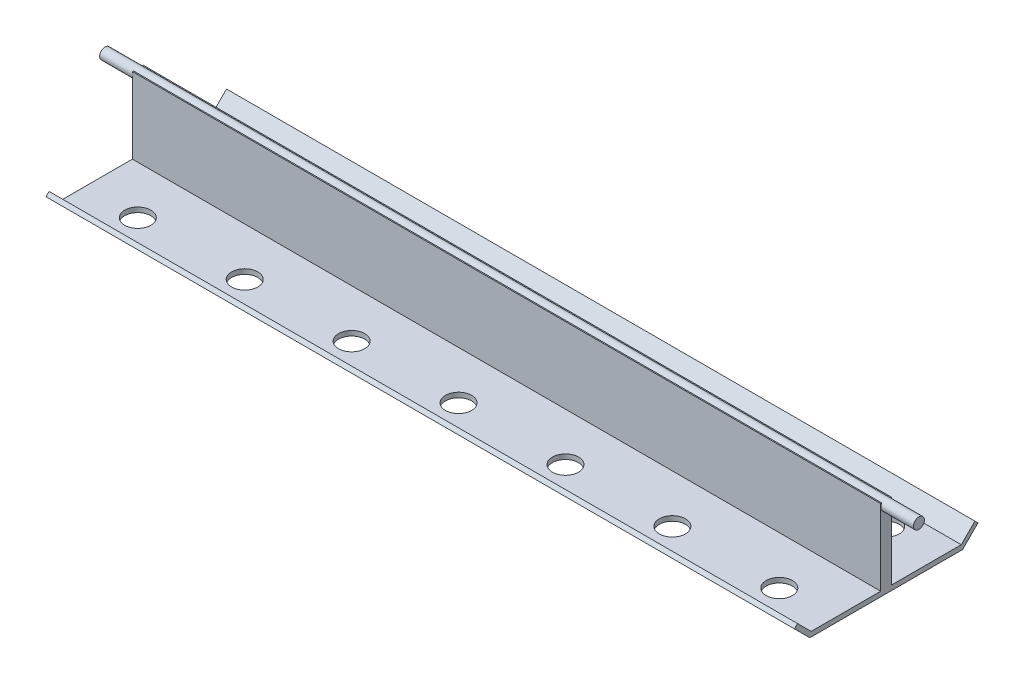
ISO-10303-21;
HEADER;
FILE_DESCRIPTION(('STEP AP214'),'2;1');
FILE_NAME('part.step','',(''),(''),'','','');
FILE_SCHEMA(('AUTOMOTIVE_DESIGN { 1 0 10303 214 1 1 1 1 }'));
ENDSEC;
DATA;
#1=APPLICATION_CONTEXT('core data for automotive mechanical design processes');
#2=APPLICATION_PROTOCOL_DEFINITION('international standard','automotive_design',2000,#1);
#3=PRODUCT_CONTEXT('',#1,'mechanical');
#4=PRODUCT('Part','Part','',(#3));
#5=PRODUCT_RELATED_PRODUCT_CATEGORY('part','',(#4));
#6=PRODUCT_DEFINITION_FORMATION('','',#4);
#7=PRODUCT_DEFINITION_CONTEXT('part definition',#1,'design');
#8=PRODUCT_DEFINITION('design','',#6,#7);
#9=PRODUCT_DEFINITION_SHAPE('','',#8);
#10=(LENGTH_UNIT() NAMED_UNIT(*) SI_UNIT(.MILLI.,.METRE.));
#11=(NAMED_UNIT(*) PLANE_ANGLE_UNIT() SI_UNIT($,.RADIAN.));
#12=(NAMED_UNIT(*) SI_UNIT($,.STERADIAN.) SOLID_ANGLE_UNIT());
#13=UNCERTAINTY_MEASURE_WITH_UNIT(LENGTH_MEASURE(1.E-05),#10,'distance_accuracy_value','');
#14=(GEOMETRIC_REPRESENTATION_CONTEXT(3) GLOBAL_UNCERTAINTY_ASSIGNED_CONTEXT((#13)) GLOBAL_UNIT_ASSIGNED_CONTEXT((#10,
#11,#12)) REPRESENTATION_CONTEXT('',''));
#15=CARTESIAN_POINT('',(0.,0.,0.));
#16=DIRECTION('',(0.,0.,1.));
#17=DIRECTION('',(1.,0.,0.));
#18=AXIS2_PLACEMENT_3D('',#15,#16,#17);
#19=CARTESIAN_POINT('',(171.5,35.,2.5));
#20=DIRECTION('',(-1.,0.,0.));
#21=DIRECTION('',(0.,0.,1.));
#22=AXIS2_PLACEMENT_3D('',#19,#20,#21);
#23=PLANE('',#22);
#24=DIRECTION('',(0.,-1.,0.));
#25=VECTOR('',#24,1.);
#26=CARTESIAN_POINT('',(171.5,35.,2.5));
#27=LINE('',#26,#25);
#28=CARTESIAN_POINT('',(171.5,35.,2.5));
#29=VERTEX_POINT('',#28);
#30=CARTESIAN_POINT('',(171.5,33.5,2.5));
#31=VERTEX_POINT('',#30);
#32=EDGE_CURVE('E240',#29,#31,#27,.T.);
#33=ORIENTED_EDGE('',*,*,#32,.T.);
#34=CARTESIAN_POINT('',(171.5,33.5,0.));
#35=DIRECTION('',(-1.,0.,0.));
#36=DIRECTION('',(0.,0.,1.));
#37=AXIS2_PLACEMENT_3D('',#34,#35,#36);
#38=CIRCLE('',#37,2.5);
#39=CARTESIAN_POINT('',(171.5,35.,2.));
#40=VERTEX_POINT('',#39);
#41=EDGE_CURVE('E228',#31,#40,#38,.T.);
#42=ORIENTED_EDGE('',*,*,#41,.T.);
#43=DIRECTION('',(0.,0.,-1.));
#44=VECTOR('',#43,1.);
#45=CARTESIAN_POINT('',(171.5,35.,2.5));
#46=LINE('',#45,#44);
#47=EDGE_CURVE('E229',#29,#40,#46,.T.);
#48=ORIENTED_EDGE('',*,*,#47,.F.);
#49=EDGE_LOOP('',(#33,#42,#48));
#50=FACE_BOUND('',#49,.T.);
#51=ADVANCED_FACE('F32',(#50),#23,.F.);
#52=CARTESIAN_POINT('',(171.5,35.,-2.));
#53=VERTEX_POINT('',#52);
#54=CARTESIAN_POINT('',(171.5,35.,-2.5));
#55=VERTEX_POINT('',#54);
#56=EDGE_CURVE('E232',#53,#55,#46,.T.);
#57=ORIENTED_EDGE('',*,*,#56,.F.);
#58=CARTESIAN_POINT('',(171.5,33.5,-2.5));
#59=VERTEX_POINT('',#58);
#60=EDGE_CURVE('E47',#53,#59,#38,.T.);
#61=ORIENTED_EDGE('',*,*,#60,.T.);
#62=DIRECTION('',(0.,-1.,0.));
#63=VECTOR('',#62,1.);
#64=CARTESIAN_POINT('',(171.5,35.,-2.5));
#65=LINE('',#64,#63);
#66=EDGE_CURVE('E252',#55,#59,#65,.T.);
#67=ORIENTED_EDGE('',*,*,#66,.F.);
#68=EDGE_LOOP('',(#57,#61,#67));
#69=FACE_BOUND('',#68,.T.);
#70=ADVANCED_FACE('F275',(#69),#23,.F.);
#71=CARTESIAN_POINT('',(-171.5,35.,2.5));
#72=DIRECTION('',(1.,0.,0.));
#73=DIRECTION('',(0.,0.,-1.));
#74=AXIS2_PLACEMENT_3D('',#71,#72,#73);
#75=PLANE('',#74);
#76=DIRECTION('',(0.,-1.,0.));
#77=VECTOR('',#76,1.);
#78=CARTESIAN_POINT('',(-171.5,35.,-2.5));
#79=LINE('',#78,#77);
#80=CARTESIAN_POINT('',(-171.5,35.,-2.5));
#81=VERTEX_POINT('',#80);
#82=CARTESIAN_POINT('',(-171.5,33.5,-2.5));
#83=VERTEX_POINT('',#82);
#84=EDGE_CURVE('E248',#81,#83,#79,.T.);
#85=ORIENTED_EDGE('',*,*,#84,.T.);
#86=CARTESIAN_POINT('',(-171.5,33.5,0.));
#87=DIRECTION('',(1.,0.,0.));
#88=DIRECTION('',(0.,0.,-1.));
#89=AXIS2_PLACEMENT_3D('',#86,#87,#88);
#90=CIRCLE('',#89,2.5);
#91=CARTESIAN_POINT('',(-171.5,35.,-2.));
#92=VERTEX_POINT('',#91);
#93=EDGE_CURVE('E220',#83,#92,#90,.T.);
#94=ORIENTED_EDGE('',*,*,#93,.T.);
#95=DIRECTION('',(0.,0.,1.));
#96=VECTOR('',#95,1.);
#97=CARTESIAN_POINT('',(-171.5,35.,2.5));
#98=LINE('',#97,#96);
#99=EDGE_CURVE('E235',#81,#92,#98,.T.);
#100=ORIENTED_EDGE('',*,*,#99,.F.);
#101=EDGE_LOOP('',(#85,#94,#100));
#102=FACE_BOUND('',#101,.T.);
#103=ADVANCED_FACE('F292',(#102),#75,.F.);
#104=CARTESIAN_POINT('',(-171.5,35.,2.));
#105=VERTEX_POINT('',#104);
#106=CARTESIAN_POINT('',(-171.5,35.,2.5));
#107=VERTEX_POINT('',#106);
#108=EDGE_CURVE('E234',#105,#107,#98,.T.);
#109=ORIENTED_EDGE('',*,*,#108,.F.);
#110=CARTESIAN_POINT('',(-171.5,33.5,2.5));
#111=VERTEX_POINT('',#110);
#112=EDGE_CURVE('E225',#105,#111,#90,.T.);
#113=ORIENTED_EDGE('',*,*,#112,.T.);
#114=DIRECTION('',(0.,-1.,0.));
#115=VECTOR('',#114,1.);
#116=CARTESIAN_POINT('',(-171.5,35.,2.5));
#117=LINE('',#116,#115);
#118=EDGE_CURVE('E244',#107,#111,#117,.T.);
#119=ORIENTED_EDGE('',*,*,#118,.F.);
#120=EDGE_LOOP('',(#109,#113,#119));
#121=FACE_BOUND('',#120,.T.);
#122=ADVANCED_FACE('F264',(#121),#75,.F.);
#123=CARTESIAN_POINT('',(0.,35.,0.));
#124=DIRECTION('',(0.,-1.,0.));
#125=DIRECTION('',(0.,0.,-1.));
#126=AXIS2_PLACEMENT_3D('',#123,#124,#125);
#127=PLANE('',#126);
#128=ORIENTED_EDGE('',*,*,#47,.T.);
#129=DIRECTION('',(-1.,0.,0.));
#130=VECTOR('',#129,1.);
#131=CARTESIAN_POINT('',(186.5,35.,2.));
#132=LINE('',#131,#130);
#133=EDGE_CURVE('E40',#40,#105,#132,.T.);
#134=ORIENTED_EDGE('',*,*,#133,.T.);
#135=ORIENTED_EDGE('',*,*,#108,.T.);
#136=DIRECTION('',(1.,0.,0.));
#137=VECTOR('',#136,1.);
#138=CARTESIAN_POINT('',(-171.5,35.,2.5));
#139=LINE('',#138,#137);
#140=EDGE_CURVE('E55',#107,#29,#139,.T.);
#141=ORIENTED_EDGE('',*,*,#140,.T.);
#142=EDGE_LOOP('',(#128,#134,#135,#141));
#143=FACE_BOUND('',#142,.T.);
#144=ADVANCED_FACE('F258',(#143),#127,.F.);
#145=CARTESIAN_POINT('',(171.5,0.230710143300813,2.5));
#146=VERTEX_POINT('',#145);
#147=EDGE_CURVE('E239',#31,#146,#27,.T.);
#148=ORIENTED_EDGE('',*,*,#147,.T.);
#149=DIRECTION('',(0.,0.,1.));
#150=VECTOR('',#149,1.);
#151=CARTESIAN_POINT('',(171.5,0.230710143300809,34.4022830185546));
#152=LINE('',#151,#150);
#153=CARTESIAN_POINT('',(171.5,0.230710143300809,34.4022830185546));
#154=VERTEX_POINT('',#153);
#155=EDGE_CURVE('E187',#146,#154,#152,.T.);
#156=ORIENTED_EDGE('',*,*,#155,.T.);
#157=DIRECTION('',(0.,0.707106781186549,0.707106781186546));
#158=VECTOR('',#157,1.);
#159=CARTESIAN_POINT('',(171.5,6.48528137423857,40.6568542494924));
#160=LINE('',#159,#158);
#161=CARTESIAN_POINT('',(171.5,6.48528137423857,40.6568542494924));
#162=VERTEX_POINT('',#161);
#163=EDGE_CURVE('E191',#154,#162,#160,.T.);
#164=ORIENTED_EDGE('',*,*,#163,.T.);
#165=DIRECTION('',(0.,-0.707106781186547,0.707106781186548));
#166=VECTOR('',#165,1.);
#167=CARTESIAN_POINT('',(171.5,5.07106781186548,42.0710678118655));
#168=LINE('',#167,#166);
#169=CARTESIAN_POINT('',(171.5,5.07106781186548,42.0710678118655));
#170=VERTEX_POINT('',#169);
#171=EDGE_CURVE('E158',#162,#170,#168,.T.);
#172=ORIENTED_EDGE('',*,*,#171,.T.);
#173=DIRECTION('',(0.,-0.707106781186549,-0.707106781186546));
#174=VECTOR('',#173,1.);
#175=CARTESIAN_POINT('',(171.5,-2.,35.));
#176=LINE('',#175,#174);
#177=CARTESIAN_POINT('',(171.5,-2.,35.));
#178=VERTEX_POINT('',#177);
#179=EDGE_CURVE('E152',#170,#178,#176,.T.);
#180=ORIENTED_EDGE('',*,*,#179,.T.);
#181=DIRECTION('',(0.,0.,-1.));
#182=VECTOR('',#181,1.);
#183=CARTESIAN_POINT('',(171.5,-2.,35.));
#184=LINE('',#183,#182);
#185=CARTESIAN_POINT('',(171.5,-2.,-35.));
#186=VERTEX_POINT('',#185);
#187=EDGE_CURVE('E161',#178,#186,#184,.T.);
#188=ORIENTED_EDGE('',*,*,#187,.T.);
#189=DIRECTION('',(0.,0.707106781186549,-0.707106781186546));
#190=VECTOR('',#189,1.);
#191=CARTESIAN_POINT('',(171.5,-2.,-35.));
#192=LINE('',#191,#190);
#193=CARTESIAN_POINT('',(171.5,5.07106781186549,-42.0710678118655));
#194=VERTEX_POINT('',#193);
#195=EDGE_CURVE('E167',#186,#194,#192,.T.);
#196=ORIENTED_EDGE('',*,*,#195,.T.);
#197=DIRECTION('',(0.,0.707106781186547,0.707106781186548));
#198=VECTOR('',#197,1.);
#199=CARTESIAN_POINT('',(171.5,5.07106781186549,-42.0710678118655));
#200=LINE('',#199,#198);
#201=CARTESIAN_POINT('',(171.5,6.48528137423858,-40.6568542494924));
#202=VERTEX_POINT('',#201);
#203=EDGE_CURVE('E181',#194,#202,#200,.T.);
#204=ORIENTED_EDGE('',*,*,#203,.T.);
#205=DIRECTION('',(0.,-0.707106781186549,0.707106781186546));
#206=VECTOR('',#205,1.);
#207=CARTESIAN_POINT('',(171.5,6.48528137423858,-40.6568542494924));
#208=LINE('',#207,#206);
#209=CARTESIAN_POINT('',(171.5,0.230710143300818,-34.4022830185546));
#210=VERTEX_POINT('',#209);
#211=EDGE_CURVE('E184',#202,#210,#208,.T.);
#212=ORIENTED_EDGE('',*,*,#211,.T.);
#213=CARTESIAN_POINT('',(171.5,0.230710143300814,-2.5));
#214=VERTEX_POINT('',#213);
#215=EDGE_CURVE('E188',#210,#214,#152,.T.);
#216=ORIENTED_EDGE('',*,*,#215,.T.);
#217=EDGE_CURVE('E251',#59,#214,#65,.T.);
#218=ORIENTED_EDGE('',*,*,#217,.F.);
#219=EDGE_CURVE('E223',#59,#31,#38,.T.);
#220=ORIENTED_EDGE('',*,*,#219,.T.);
#221=EDGE_LOOP('',(#148,#156,#164,#172,#180,#188,#196,#204,#212,#216,#218,#220));
#222=FACE_BOUND('',#221,.T.);
#223=ADVANCED_FACE('F34',(#222),#23,.F.);
#224=CARTESIAN_POINT('',(-171.5,35.,-2.5));
#225=DIRECTION('',(0.,0.,1.));
#226=DIRECTION('',(1.,0.,0.));
#227=AXIS2_PLACEMENT_3D('',#224,#225,#226);
#228=PLANE('',#227);
#229=ORIENTED_EDGE('',*,*,#217,.T.);
#230=DIRECTION('',(-1.,0.,0.));
#231=VECTOR('',#230,1.);
#232=CARTESIAN_POINT('',(-171.5,0.230710143300818,-2.5));
#233=LINE('',#232,#231);
#234=CARTESIAN_POINT('',(-171.5,0.230710143300814,-2.5));
#235=VERTEX_POINT('',#234);
#236=EDGE_CURVE('E211',#214,#235,#233,.T.);
#237=ORIENTED_EDGE('',*,*,#236,.T.);
#238=EDGE_CURVE('E247',#83,#235,#79,.T.);
#239=ORIENTED_EDGE('',*,*,#238,.F.);
#240=ORIENTED_EDGE('',*,*,#84,.F.);
#241=DIRECTION('',(-1.,0.,0.));
#242=VECTOR('',#241,1.);
#243=CARTESIAN_POINT('',(-171.5,35.,-2.5));
#244=LINE('',#243,#242);
#245=EDGE_CURVE('E231',#55,#81,#244,.T.);
#246=ORIENTED_EDGE('',*,*,#245,.F.);
#247=ORIENTED_EDGE('',*,*,#66,.T.);
#248=EDGE_LOOP('',(#229,#237,#239,#240,#246,#247));
#249=FACE_BOUND('',#248,.T.);
#250=ADVANCED_FACE('F280',(#249),#228,.F.);
#251=ORIENTED_EDGE('',*,*,#238,.T.);
#252=DIRECTION('',(0.,0.,-1.));
#253=VECTOR('',#252,1.);
#254=CARTESIAN_POINT('',(-171.5,0.230710143300809,34.4022830185546));
#255=LINE('',#254,#253);
#256=CARTESIAN_POINT('',(-171.5,0.230710143300818,-34.4022830185546));
#257=VERTEX_POINT('',#256);
#258=EDGE_CURVE('E705',#235,#257,#255,.T.);
#259=ORIENTED_EDGE('',*,*,#258,.T.);
#260=DIRECTION('',(0.,0.707106781186549,-0.707106781186546));
#261=VECTOR('',#260,1.);
#262=CARTESIAN_POINT('',(-171.5,6.48528137423858,-40.6568542494924));
#263=LINE('',#262,#261);
#264=CARTESIAN_POINT('',(-171.5,6.48528137423858,-40.6568542494924));
#265=VERTEX_POINT('',#264);
#266=EDGE_CURVE('E703',#257,#265,#263,.T.);
#267=ORIENTED_EDGE('',*,*,#266,.T.);
#268=DIRECTION('',(0.,-0.707106781186547,-0.707106781186548));
#269=VECTOR('',#268,1.);
#270=CARTESIAN_POINT('',(-171.5,5.07106781186549,-42.0710678118655));
#271=LINE('',#270,#269);
#272=CARTESIAN_POINT('',(-171.5,5.07106781186549,-42.0710678118655));
#273=VERTEX_POINT('',#272);
#274=EDGE_CURVE('E701',#265,#273,#271,.T.);
#275=ORIENTED_EDGE('',*,*,#274,.T.);
#276=DIRECTION('',(0.,-0.707106781186549,0.707106781186546));
#277=VECTOR('',#276,1.);
#278=CARTESIAN_POINT('',(-171.5,-2.,-35.));
#279=LINE('',#278,#277);
#280=CARTESIAN_POINT('',(-171.5,-2.,-35.));
#281=VERTEX_POINT('',#280);
#282=EDGE_CURVE('E196',#273,#281,#279,.T.);
#283=ORIENTED_EDGE('',*,*,#282,.T.);
#284=DIRECTION('',(0.,0.,1.));
#285=VECTOR('',#284,1.);
#286=CARTESIAN_POINT('',(-171.5,-2.,35.));
#287=LINE('',#286,#285);
#288=CARTESIAN_POINT('',(-171.5,-2.,35.));
#289=VERTEX_POINT('',#288);
#290=EDGE_CURVE('E209',#281,#289,#287,.T.);
#291=ORIENTED_EDGE('',*,*,#290,.T.);
#292=DIRECTION('',(0.,0.707106781186549,0.707106781186546));
#293=VECTOR('',#292,1.);
#294=CARTESIAN_POINT('',(-171.5,-2.,35.));
#295=LINE('',#294,#293);
#296=CARTESIAN_POINT('',(-171.5,5.07106781186548,42.0710678118655));
#297=VERTEX_POINT('',#296);
#298=EDGE_CURVE('E154',#289,#297,#295,.T.);
#299=ORIENTED_EDGE('',*,*,#298,.T.);
#300=DIRECTION('',(0.,0.707106781186547,-0.707106781186548));
#301=VECTOR('',#300,1.);
#302=CARTESIAN_POINT('',(-171.5,5.07106781186548,42.0710678118655));
#303=LINE('',#302,#301);
#304=CARTESIAN_POINT('',(-171.5,6.48528137423857,40.6568542494924));
#305=VERTEX_POINT('',#304);
#306=EDGE_CURVE('E709',#297,#305,#303,.T.);
#307=ORIENTED_EDGE('',*,*,#306,.T.);
#308=DIRECTION('',(0.,-0.707106781186549,-0.707106781186546));
#309=VECTOR('',#308,1.);
#310=CARTESIAN_POINT('',(-171.5,6.48528137423857,40.6568542494924));
#311=LINE('',#310,#309);
#312=CARTESIAN_POINT('',(-171.5,0.230710143300809,34.4022830185546));
#313=VERTEX_POINT('',#312);
#314=EDGE_CURVE('E708',#305,#313,#311,.T.);
#315=ORIENTED_EDGE('',*,*,#314,.T.);
#316=CARTESIAN_POINT('',(-171.5,0.230710143300813,2.5));
#317=VERTEX_POINT('',#316);
#318=EDGE_CURVE('E706',#313,#317,#255,.T.);
#319=ORIENTED_EDGE('',*,*,#318,.T.);
#320=EDGE_CURVE('E243',#111,#317,#117,.T.);
#321=ORIENTED_EDGE('',*,*,#320,.F.);
#322=EDGE_CURVE('E224',#111,#83,#90,.T.);
#323=ORIENTED_EDGE('',*,*,#322,.T.);
#324=EDGE_LOOP('',(#251,#259,#267,#275,#283,#291,#299,#307,#315,#319,#321,#323));
#325=FACE_BOUND('',#324,.T.);
#326=ADVANCED_FACE('F289',(#325),#75,.F.);
#327=CARTESIAN_POINT('',(-171.5,35.,2.5));
#328=DIRECTION('',(0.,0.,-1.));
#329=DIRECTION('',(-1.,0.,0.));
#330=AXIS2_PLACEMENT_3D('',#327,#328,#329);
#331=PLANE('',#330);
#332=ORIENTED_EDGE('',*,*,#320,.T.);
#333=DIRECTION('',(1.,0.,0.));
#334=VECTOR('',#333,1.);
#335=CARTESIAN_POINT('',(-171.5,0.230710143300818,2.5));
#336=LINE('',#335,#334);
#337=EDGE_CURVE('E11',#317,#146,#336,.T.);
#338=ORIENTED_EDGE('',*,*,#337,.T.);
#339=ORIENTED_EDGE('',*,*,#147,.F.);
#340=ORIENTED_EDGE('',*,*,#32,.F.);
#341=ORIENTED_EDGE('',*,*,#140,.F.);
#342=ORIENTED_EDGE('',*,*,#118,.T.);
#343=EDGE_LOOP('',(#332,#338,#339,#340,#341,#342));
#344=FACE_BOUND('',#343,.T.);
#345=ADVANCED_FACE('F268',(#344),#331,.F.);
#346=ORIENTED_EDGE('',*,*,#99,.T.);
#347=DIRECTION('',(-1.,0.,0.));
#348=VECTOR('',#347,1.);
#349=CARTESIAN_POINT('',(186.5,35.,-2.));
#350=LINE('',#349,#348);
#351=EDGE_CURVE('E255',#92,#53,#350,.F.);
#352=ORIENTED_EDGE('',*,*,#351,.T.);
#353=ORIENTED_EDGE('',*,*,#56,.T.);
#354=ORIENTED_EDGE('',*,*,#245,.T.);
#355=EDGE_LOOP('',(#346,#352,#353,#354));
#356=FACE_BOUND('',#355,.T.);
#357=ADVANCED_FACE('F285',(#356),#127,.F.);
#358=CARTESIAN_POINT('',(186.5,33.5,0.));
#359=DIRECTION('',(-1.,0.,0.));
#360=DIRECTION('',(0.,0.,1.));
#361=AXIS2_PLACEMENT_3D('',#358,#359,#360);
#362=CYLINDRICAL_SURFACE('',#361,2.5);
#363=CARTESIAN_POINT('',(186.5,33.5,0.));
#364=DIRECTION('',(-1.,0.,0.));
#365=DIRECTION('',(0.,0.,1.));
#366=AXIS2_PLACEMENT_3D('',#363,#364,#365);
#367=CIRCLE('',#366,2.5);
#368=CARTESIAN_POINT('',(186.5,33.5,2.5));
#369=VERTEX_POINT('',#368);
#370=EDGE_CURVE('E217',#369,#369,#367,.T.);
#371=ORIENTED_EDGE('',*,*,#370,.T.);
#372=EDGE_LOOP('',(#371));
#373=FACE_BOUND('',#372,.T.);
#374=CARTESIAN_POINT('',(-186.5,33.5,0.));
#375=DIRECTION('',(-1.,0.,0.));
#376=DIRECTION('',(0.,0.,1.));
#377=AXIS2_PLACEMENT_3D('',#374,#375,#376);
#378=CIRCLE('',#377,2.5);
#379=CARTESIAN_POINT('',(-186.5,33.5,2.5));
#380=VERTEX_POINT('',#379);
#381=EDGE_CURVE('E214',#380,#380,#378,.T.);
#382=ORIENTED_EDGE('',*,*,#381,.F.);
#383=EDGE_LOOP('',(#382));
#384=FACE_BOUND('',#383,.T.);
#385=ORIENTED_EDGE('',*,*,#322,.F.);
#386=ORIENTED_EDGE('',*,*,#112,.F.);
#387=ORIENTED_EDGE('',*,*,#133,.F.);
#388=ORIENTED_EDGE('',*,*,#41,.F.);
#389=ORIENTED_EDGE('',*,*,#219,.F.);
#390=ORIENTED_EDGE('',*,*,#60,.F.);
#391=ORIENTED_EDGE('',*,*,#351,.F.);
#392=ORIENTED_EDGE('',*,*,#93,.F.);
#393=EDGE_LOOP('',(#385,#386,#387,#388,#389,#390,#391,#392));
#394=FACE_BOUND('',#393,.T.);
#395=ADVANCED_FACE('F293',(#373,#384,#394),#362,.T.);
#396=CARTESIAN_POINT('',(186.5,33.5,0.));
#397=DIRECTION('',(-1.,0.,0.));
#398=DIRECTION('',(0.,0.,1.));
#399=AXIS2_PLACEMENT_3D('',#396,#397,#398);
#400=PLANE('',#399);
#401=ORIENTED_EDGE('',*,*,#370,.F.);
#402=EDGE_LOOP('',(#401));
#403=FACE_BOUND('',#402,.T.);
#404=ADVANCED_FACE('F295',(#403),#400,.F.);
#405=CARTESIAN_POINT('',(-186.5,33.5,0.));
#406=DIRECTION('',(-1.,0.,0.));
#407=DIRECTION('',(0.,0.,1.));
#408=AXIS2_PLACEMENT_3D('',#405,#406,#407);
#409=PLANE('',#408);
#410=ORIENTED_EDGE('',*,*,#381,.T.);
#411=EDGE_LOOP('',(#410));
#412=FACE_BOUND('',#411,.T.);
#413=ADVANCED_FACE('F302',(#412),#409,.T.);
#414=CARTESIAN_POINT('',(-256.068900828392,0.230710143300809,34.4022830185546));
#415=DIRECTION('',(0.,1.,0.));
#416=DIRECTION('',(0.,0.,1.));
#417=AXIS2_PLACEMENT_3D('',#414,#415,#416);
#418=PLANE('',#417);
#419=CARTESIAN_POINT('',(-49.,0.230710143300816,-24.5));
#420=DIRECTION('',(0.,1.,0.));
#421=DIRECTION('',(0.,0.,-1.));
#422=AXIS2_PLACEMENT_3D('',#419,#420,#421);
#423=CIRCLE('',#422,5.99996045760367);
#424=CARTESIAN_POINT('',(-49.,0.230710143300817,-30.4999604576037));
#425=VERTEX_POINT('',#424);
#426=EDGE_CURVE('E619',#425,#425,#423,.T.);
#427=ORIENTED_EDGE('',*,*,#426,.F.);
#428=EDGE_LOOP('',(#427));
#429=FACE_BOUND('',#428,.T.);
#430=CARTESIAN_POINT('',(-97.9999999999999,0.230710143300816,-24.5));
#431=DIRECTION('',(0.,1.,0.));
#432=DIRECTION('',(0.,0.,-1.));
#433=AXIS2_PLACEMENT_3D('',#430,#431,#432);
#434=CIRCLE('',#433,6.);
#435=CARTESIAN_POINT('',(-97.9999999999999,0.230710143300817,-30.5));
#436=VERTEX_POINT('',#435);
#437=EDGE_CURVE('E623',#436,#436,#434,.T.);
#438=ORIENTED_EDGE('',*,*,#437,.F.);
#439=EDGE_LOOP('',(#438));
#440=FACE_BOUND('',#439,.T.);
#441=CARTESIAN_POINT('',(-147.,0.230710143300816,-24.5));
#442=DIRECTION('',(0.,1.,0.));
#443=DIRECTION('',(0.,0.,-1.));
#444=AXIS2_PLACEMENT_3D('',#441,#442,#443);
#445=CIRCLE('',#444,6.00000000000002);
#446=CARTESIAN_POINT('',(-147.,0.230710143300817,-30.5));
#447=VERTEX_POINT('',#446);
#448=EDGE_CURVE('E632',#447,#447,#445,.T.);
#449=ORIENTED_EDGE('',*,*,#448,.F.);
#450=EDGE_LOOP('',(#449));
#451=FACE_BOUND('',#450,.T.);
#452=CARTESIAN_POINT('',(0.,0.230710143300816,-24.5));
#453=DIRECTION('',(0.,1.,0.));
#454=DIRECTION('',(0.,0.,-1.));
#455=AXIS2_PLACEMENT_3D('',#452,#453,#454);
#456=CIRCLE('',#455,6.);
#457=CARTESIAN_POINT('',(0.,0.230710143300817,-30.5));
#458=VERTEX_POINT('',#457);
#459=EDGE_CURVE('E638',#458,#458,#456,.T.);
#460=ORIENTED_EDGE('',*,*,#459,.F.);
#461=EDGE_LOOP('',(#460));
#462=FACE_BOUND('',#461,.T.);
#463=CARTESIAN_POINT('',(49.,0.230710143300816,-24.5));
#464=DIRECTION('',(0.,1.,0.));
#465=DIRECTION('',(0.,0.,1.));
#466=AXIS2_PLACEMENT_3D('',#463,#464,#465);
#467=CIRCLE('',#466,5.99996045760367);
#468=CARTESIAN_POINT('',(49.,0.230710143300816,-18.5000395423963));
#469=VERTEX_POINT('',#468);
#470=EDGE_CURVE('E644',#469,#469,#467,.T.);
#471=ORIENTED_EDGE('',*,*,#470,.F.);
#472=EDGE_LOOP('',(#471));
#473=FACE_BOUND('',#472,.T.);
#474=CARTESIAN_POINT('',(147.,0.230710143300816,-24.5));
#475=DIRECTION('',(0.,1.,0.));
#476=DIRECTION('',(0.,0.,1.));
#477=AXIS2_PLACEMENT_3D('',#474,#475,#476);
#478=CIRCLE('',#477,6.00000000000002);
#479=CARTESIAN_POINT('',(147.,0.230710143300816,-18.5));
#480=VERTEX_POINT('',#479);
#481=EDGE_CURVE('E650',#480,#480,#478,.T.);
#482=ORIENTED_EDGE('',*,*,#481,.F.);
#483=EDGE_LOOP('',(#482));
#484=FACE_BOUND('',#483,.T.);
#485=CARTESIAN_POINT('',(97.9999999999999,0.230710143300816,-24.5));
#486=DIRECTION('',(0.,1.,0.));
#487=DIRECTION('',(0.,0.,1.));
#488=AXIS2_PLACEMENT_3D('',#485,#486,#487);
#489=CIRCLE('',#488,6.);
#490=CARTESIAN_POINT('',(97.9999999999999,0.230710143300816,-18.5));
#491=VERTEX_POINT('',#490);
#492=EDGE_CURVE('E656',#491,#491,#489,.T.);
#493=ORIENTED_EDGE('',*,*,#492,.F.);
#494=EDGE_LOOP('',(#493));
#495=FACE_BOUND('',#494,.T.);
#496=ORIENTED_EDGE('',*,*,#236,.F.);
#497=ORIENTED_EDGE('',*,*,#215,.F.);
#498=DIRECTION('',(1.,0.,0.));
#499=VECTOR('',#498,1.);
#500=CARTESIAN_POINT('',(-256.068900828392,0.230710143300818,-34.4022830185546));
#501=LINE('',#500,#499);
#502=EDGE_CURVE('E202',#257,#210,#501,.T.);
#503=ORIENTED_EDGE('',*,*,#502,.F.);
#504=ORIENTED_EDGE('',*,*,#258,.F.);
#505=EDGE_LOOP('',(#496,#497,#503,#504));
#506=FACE_BOUND('',#505,.T.);
#507=ADVANCED_FACE('F364',(#429,#440,#451,#462,#473,#484,#495,#506),#418,.T.);
#508=CARTESIAN_POINT('',(49.,0.23071014330081,24.5));
#509=DIRECTION('',(0.,1.,0.));
#510=DIRECTION('',(0.,0.,-1.));
#511=AXIS2_PLACEMENT_3D('',#508,#509,#510);
#512=CIRCLE('',#511,5.99996045760367);
#513=CARTESIAN_POINT('',(49.,0.230710143300811,18.5000395423963));
#514=VERTEX_POINT('',#513);
#515=EDGE_CURVE('E662',#514,#514,#512,.T.);
#516=ORIENTED_EDGE('',*,*,#515,.F.);
#517=EDGE_LOOP('',(#516));
#518=FACE_BOUND('',#517,.T.);
#519=CARTESIAN_POINT('',(98.,0.23071014330081,24.5));
#520=DIRECTION('',(0.,1.,0.));
#521=DIRECTION('',(0.,0.,-1.));
#522=AXIS2_PLACEMENT_3D('',#519,#520,#521);
#523=CIRCLE('',#522,6.);
#524=CARTESIAN_POINT('',(98.,0.230710143300811,18.5));
#525=VERTEX_POINT('',#524);
#526=EDGE_CURVE('E668',#525,#525,#523,.T.);
#527=ORIENTED_EDGE('',*,*,#526,.F.);
#528=EDGE_LOOP('',(#527));
#529=FACE_BOUND('',#528,.T.);
#530=CARTESIAN_POINT('',(147.,0.23071014330081,24.5));
#531=DIRECTION('',(0.,1.,0.));
#532=DIRECTION('',(0.,0.,-1.));
#533=AXIS2_PLACEMENT_3D('',#530,#531,#532);
#534=CIRCLE('',#533,6.00000000000002);
#535=CARTESIAN_POINT('',(147.,0.230710143300811,18.5));
#536=VERTEX_POINT('',#535);
#537=EDGE_CURVE('E674',#536,#536,#534,.T.);
#538=ORIENTED_EDGE('',*,*,#537,.F.);
#539=EDGE_LOOP('',(#538));
#540=FACE_BOUND('',#539,.T.);
#541=CARTESIAN_POINT('',(-147.,0.23071014330081,24.5));
#542=DIRECTION('',(0.,1.,0.));
#543=DIRECTION('',(0.,0.,1.));
#544=AXIS2_PLACEMENT_3D('',#541,#542,#543);
#545=CIRCLE('',#544,6.00000000000002);
#546=CARTESIAN_POINT('',(-147.,0.23071014330081,30.5));
#547=VERTEX_POINT('',#546);
#548=EDGE_CURVE('E680',#547,#547,#545,.T.);
#549=ORIENTED_EDGE('',*,*,#548,.F.);
#550=EDGE_LOOP('',(#549));
#551=FACE_BOUND('',#550,.T.);
#552=CARTESIAN_POINT('',(-98.,0.23071014330081,24.5));
#553=DIRECTION('',(0.,1.,0.));
#554=DIRECTION('',(0.,0.,1.));
#555=AXIS2_PLACEMENT_3D('',#552,#553,#554);
#556=CIRCLE('',#555,6.);
#557=CARTESIAN_POINT('',(-98.,0.23071014330081,30.5));
#558=VERTEX_POINT('',#557);
#559=EDGE_CURVE('E686',#558,#558,#556,.T.);
#560=ORIENTED_EDGE('',*,*,#559,.F.);
#561=EDGE_LOOP('',(#560));
#562=FACE_BOUND('',#561,.T.);
#563=CARTESIAN_POINT('',(-49.,0.23071014330081,24.5));
#564=DIRECTION('',(0.,1.,0.));
#565=DIRECTION('',(0.,0.,1.));
#566=AXIS2_PLACEMENT_3D('',#563,#564,#565);
#567=CIRCLE('',#566,5.99996045760367);
#568=CARTESIAN_POINT('',(-49.,0.23071014330081,30.4999604576037));
#569=VERTEX_POINT('',#568);
#570=EDGE_CURVE('E692',#569,#569,#567,.T.);
#571=ORIENTED_EDGE('',*,*,#570,.F.);
#572=EDGE_LOOP('',(#571));
#573=FACE_BOUND('',#572,.T.);
#574=CARTESIAN_POINT('',(0.,0.23071014330081,24.5));
#575=DIRECTION('',(0.,1.,0.));
#576=DIRECTION('',(0.,0.,1.));
#577=AXIS2_PLACEMENT_3D('',#574,#575,#576);
#578=CIRCLE('',#577,6.);
#579=CARTESIAN_POINT('',(0.,0.23071014330081,30.5));
#580=VERTEX_POINT('',#579);
#581=EDGE_CURVE('E175',#580,#580,#578,.T.);
#582=ORIENTED_EDGE('',*,*,#581,.F.);
#583=EDGE_LOOP('',(#582));
#584=FACE_BOUND('',#583,.T.);
#585=ORIENTED_EDGE('',*,*,#337,.F.);
#586=ORIENTED_EDGE('',*,*,#318,.F.);
#587=DIRECTION('',(1.,0.,0.));
#588=VECTOR('',#587,1.);
#589=CARTESIAN_POINT('',(-256.068900828392,0.230710143300809,34.4022830185546));
#590=LINE('',#589,#588);
#591=EDGE_CURVE('E199',#313,#154,#590,.T.);
#592=ORIENTED_EDGE('',*,*,#591,.T.);
#593=ORIENTED_EDGE('',*,*,#155,.F.);
#594=EDGE_LOOP('',(#585,#586,#592,#593));
#595=FACE_BOUND('',#594,.T.);
#596=ADVANCED_FACE('F399',(#518,#529,#540,#551,#562,#573,#584,#595),#418,.T.);
#597=CARTESIAN_POINT('',(-256.068900828392,-2.,35.));
#598=DIRECTION('',(0.,-0.707106781186546,0.707106781186549));
#599=DIRECTION('',(0.,-0.707106781186549,-0.707106781186546));
#600=AXIS2_PLACEMENT_3D('',#597,#598,#599);
#601=PLANE('',#600);
#602=ORIENTED_EDGE('',*,*,#298,.F.);
#603=DIRECTION('',(1.,0.,0.));
#604=VECTOR('',#603,1.);
#605=CARTESIAN_POINT('',(-256.068900828392,-2.,35.));
#606=LINE('',#605,#604);
#607=EDGE_CURVE('E147',#289,#178,#606,.T.);
#608=ORIENTED_EDGE('',*,*,#607,.T.);
#609=ORIENTED_EDGE('',*,*,#179,.F.);
#610=DIRECTION('',(1.,0.,0.));
#611=VECTOR('',#610,1.);
#612=CARTESIAN_POINT('',(-256.068900828392,5.07106781186548,42.0710678118655));
#613=LINE('',#612,#611);
#614=EDGE_CURVE('E194',#297,#170,#613,.T.);
#615=ORIENTED_EDGE('',*,*,#614,.F.);
#616=EDGE_LOOP('',(#602,#608,#609,#615));
#617=FACE_BOUND('',#616,.T.);
#618=ADVANCED_FACE('F149',(#617),#601,.T.);
#619=CARTESIAN_POINT('',(-256.068900828392,5.07106781186548,42.0710678118655));
#620=DIRECTION('',(0.,0.707106781186548,0.707106781186547));
#621=DIRECTION('',(0.,-0.707106781186547,0.707106781186548));
#622=AXIS2_PLACEMENT_3D('',#619,#620,#621);
#623=PLANE('',#622);
#624=ORIENTED_EDGE('',*,*,#306,.F.);
#625=ORIENTED_EDGE('',*,*,#614,.T.);
#626=ORIENTED_EDGE('',*,*,#171,.F.);
#627=DIRECTION('',(1.,0.,0.));
#628=VECTOR('',#627,1.);
#629=CARTESIAN_POINT('',(-256.068900828392,6.48528137423857,40.6568542494924));
#630=LINE('',#629,#628);
#631=EDGE_CURVE('E197',#305,#162,#630,.T.);
#632=ORIENTED_EDGE('',*,*,#631,.F.);
#633=EDGE_LOOP('',(#624,#625,#626,#632));
#634=FACE_BOUND('',#633,.T.);
#635=ADVANCED_FACE('F398',(#634),#623,.T.);
#636=CARTESIAN_POINT('',(-256.068900828392,6.48528137423857,40.6568542494924));
#637=DIRECTION('',(0.,0.707106781186546,-0.707106781186549));
#638=DIRECTION('',(0.,0.707106781186549,0.707106781186546));
#639=AXIS2_PLACEMENT_3D('',#636,#637,#638);
#640=PLANE('',#639);
#641=ORIENTED_EDGE('',*,*,#314,.F.);
#642=ORIENTED_EDGE('',*,*,#631,.T.);
#643=ORIENTED_EDGE('',*,*,#163,.F.);
#644=ORIENTED_EDGE('',*,*,#591,.F.);
#645=EDGE_LOOP('',(#641,#642,#643,#644));
#646=FACE_BOUND('',#645,.T.);
#647=ADVANCED_FACE('F410',(#646),#640,.T.);
#648=CARTESIAN_POINT('',(-256.068900828392,6.48528137423858,-40.6568542494924));
#649=DIRECTION('',(0.,0.707106781186546,0.707106781186549));
#650=DIRECTION('',(0.,-0.707106781186549,0.707106781186546));
#651=AXIS2_PLACEMENT_3D('',#648,#649,#650);
#652=PLANE('',#651);
#653=ORIENTED_EDGE('',*,*,#266,.F.);
#654=ORIENTED_EDGE('',*,*,#502,.T.);
#655=ORIENTED_EDGE('',*,*,#211,.F.);
#656=DIRECTION('',(1.,0.,0.));
#657=VECTOR('',#656,1.);
#658=CARTESIAN_POINT('',(-256.068900828392,6.48528137423858,-40.6568542494924));
#659=LINE('',#658,#657);
#660=EDGE_CURVE('E204',#265,#202,#659,.T.);
#661=ORIENTED_EDGE('',*,*,#660,.F.);
#662=EDGE_LOOP('',(#653,#654,#655,#661));
#663=FACE_BOUND('',#662,.T.);
#664=ADVANCED_FACE('F420',(#663),#652,.T.);
#665=CARTESIAN_POINT('',(-256.068900828392,5.07106781186549,-42.0710678118655));
#666=DIRECTION('',(0.,0.707106781186548,-0.707106781186547));
#667=DIRECTION('',(0.,0.707106781186547,0.707106781186548));
#668=AXIS2_PLACEMENT_3D('',#665,#666,#667);
#669=PLANE('',#668);
#670=ORIENTED_EDGE('',*,*,#274,.F.);
#671=ORIENTED_EDGE('',*,*,#660,.T.);
#672=ORIENTED_EDGE('',*,*,#203,.F.);
#673=DIRECTION('',(1.,0.,0.));
#674=VECTOR('',#673,1.);
#675=CARTESIAN_POINT('',(-256.068900828392,5.07106781186549,-42.0710678118655));
#676=LINE('',#675,#674);
#677=EDGE_CURVE('E206',#273,#194,#676,.T.);
#678=ORIENTED_EDGE('',*,*,#677,.F.);
#679=EDGE_LOOP('',(#670,#671,#672,#678));
#680=FACE_BOUND('',#679,.T.);
#681=ADVANCED_FACE('F430',(#680),#669,.T.);
#682=CARTESIAN_POINT('',(-256.068900828392,-2.,-35.));
#683=DIRECTION('',(0.,-0.707106781186546,-0.707106781186549));
#684=DIRECTION('',(0.,0.707106781186549,-0.707106781186546));
#685=AXIS2_PLACEMENT_3D('',#682,#683,#684);
#686=PLANE('',#685);
#687=ORIENTED_EDGE('',*,*,#282,.F.);
#688=ORIENTED_EDGE('',*,*,#677,.T.);
#689=ORIENTED_EDGE('',*,*,#195,.F.);
#690=DIRECTION('',(1.,0.,0.));
#691=VECTOR('',#690,1.);
#692=CARTESIAN_POINT('',(-256.068900828392,-2.,-35.));
#693=LINE('',#692,#691);
#694=EDGE_CURVE('E157',#281,#186,#693,.T.);
#695=ORIENTED_EDGE('',*,*,#694,.F.);
#696=EDGE_LOOP('',(#687,#688,#689,#695));
#697=FACE_BOUND('',#696,.T.);
#698=ADVANCED_FACE('F440',(#697),#686,.T.);
#699=CARTESIAN_POINT('',(-256.068900828392,-2.,35.));
#700=DIRECTION('',(0.,-1.,0.));
#701=DIRECTION('',(0.,0.,-1.));
#702=AXIS2_PLACEMENT_3D('',#699,#700,#701);
#703=PLANE('',#702);
#704=CARTESIAN_POINT('',(-49.,-2.,-24.5));
#705=DIRECTION('',(0.,-1.,0.));
#706=DIRECTION('',(0.,0.,-1.));
#707=AXIS2_PLACEMENT_3D('',#704,#705,#706);
#708=CIRCLE('',#707,5.99996045760367);
#709=CARTESIAN_POINT('',(-49.,-2.,-30.4999604576037));
#710=VERTEX_POINT('',#709);
#711=EDGE_CURVE('E622',#710,#710,#708,.F.);
#712=ORIENTED_EDGE('',*,*,#711,.T.);
#713=EDGE_LOOP('',(#712));
#714=FACE_BOUND('',#713,.T.);
#715=CARTESIAN_POINT('',(-97.9999999999999,-2.,-24.5));
#716=DIRECTION('',(0.,-1.,0.));
#717=DIRECTION('',(0.,0.,-1.));
#718=AXIS2_PLACEMENT_3D('',#715,#716,#717);
#719=CIRCLE('',#718,6.);
#720=CARTESIAN_POINT('',(-97.9999999999999,-2.,-30.5));
#721=VERTEX_POINT('',#720);
#722=EDGE_CURVE('E626',#721,#721,#719,.F.);
#723=ORIENTED_EDGE('',*,*,#722,.T.);
#724=EDGE_LOOP('',(#723));
#725=FACE_BOUND('',#724,.T.);
#726=CARTESIAN_POINT('',(-147.,-2.,-24.5));
#727=DIRECTION('',(0.,-1.,0.));
#728=DIRECTION('',(0.,0.,-1.));
#729=AXIS2_PLACEMENT_3D('',#726,#727,#728);
#730=CIRCLE('',#729,6.00000000000002);
#731=CARTESIAN_POINT('',(-147.,-2.,-30.5));
#732=VERTEX_POINT('',#731);
#733=EDGE_CURVE('E635',#732,#732,#730,.F.);
#734=ORIENTED_EDGE('',*,*,#733,.T.);
#735=EDGE_LOOP('',(#734));
#736=FACE_BOUND('',#735,.T.);
#737=CARTESIAN_POINT('',(0.,-2.,-24.5));
#738=DIRECTION('',(0.,-1.,0.));
#739=DIRECTION('',(0.,0.,-1.));
#740=AXIS2_PLACEMENT_3D('',#737,#738,#739);
#741=CIRCLE('',#740,6.);
#742=CARTESIAN_POINT('',(0.,-2.,-30.5));
#743=VERTEX_POINT('',#742);
#744=EDGE_CURVE('E641',#743,#743,#741,.F.);
#745=ORIENTED_EDGE('',*,*,#744,.T.);
#746=EDGE_LOOP('',(#745));
#747=FACE_BOUND('',#746,.T.);
#748=CARTESIAN_POINT('',(49.,-2.,-24.5));
#749=DIRECTION('',(0.,-1.,0.));
#750=DIRECTION('',(0.,0.,-1.));
#751=AXIS2_PLACEMENT_3D('',#748,#749,#750);
#752=CIRCLE('',#751,5.99996045760367);
#753=CARTESIAN_POINT('',(49.,-2.,-30.4999604576036));
#754=VERTEX_POINT('',#753);
#755=EDGE_CURVE('E647',#754,#754,#752,.F.);
#756=ORIENTED_EDGE('',*,*,#755,.T.);
#757=EDGE_LOOP('',(#756));
#758=FACE_BOUND('',#757,.T.);
#759=CARTESIAN_POINT('',(147.,-2.,-24.5));
#760=DIRECTION('',(0.,-1.,0.));
#761=DIRECTION('',(0.,0.,-1.));
#762=AXIS2_PLACEMENT_3D('',#759,#760,#761);
#763=CIRCLE('',#762,6.00000000000002);
#764=CARTESIAN_POINT('',(147.,-2.,-30.5));
#765=VERTEX_POINT('',#764);
#766=EDGE_CURVE('E653',#765,#765,#763,.F.);
#767=ORIENTED_EDGE('',*,*,#766,.T.);
#768=EDGE_LOOP('',(#767));
#769=FACE_BOUND('',#768,.T.);
#770=CARTESIAN_POINT('',(97.9999999999999,-2.,-24.5));
#771=DIRECTION('',(0.,-1.,0.));
#772=DIRECTION('',(0.,0.,-1.));
#773=AXIS2_PLACEMENT_3D('',#770,#771,#772);
#774=CIRCLE('',#773,6.);
#775=CARTESIAN_POINT('',(97.9999999999999,-2.,-30.5));
#776=VERTEX_POINT('',#775);
#777=EDGE_CURVE('E659',#776,#776,#774,.F.);
#778=ORIENTED_EDGE('',*,*,#777,.T.);
#779=EDGE_LOOP('',(#778));
#780=FACE_BOUND('',#779,.T.);
#781=CARTESIAN_POINT('',(49.,-2.,24.5));
#782=DIRECTION('',(0.,-1.,0.));
#783=DIRECTION('',(0.,0.,-1.));
#784=AXIS2_PLACEMENT_3D('',#781,#782,#783);
#785=CIRCLE('',#784,5.99996045760367);
#786=CARTESIAN_POINT('',(49.,-2.,18.5000395423963));
#787=VERTEX_POINT('',#786);
#788=EDGE_CURVE('E665',#787,#787,#785,.F.);
#789=ORIENTED_EDGE('',*,*,#788,.T.);
#790=EDGE_LOOP('',(#789));
#791=FACE_BOUND('',#790,.T.);
#792=CARTESIAN_POINT('',(98.,-2.,24.5));
#793=DIRECTION('',(0.,-1.,0.));
#794=DIRECTION('',(0.,0.,-1.));
#795=AXIS2_PLACEMENT_3D('',#792,#793,#794);
#796=CIRCLE('',#795,6.);
#797=CARTESIAN_POINT('',(98.,-2.,18.5));
#798=VERTEX_POINT('',#797);
#799=EDGE_CURVE('E671',#798,#798,#796,.F.);
#800=ORIENTED_EDGE('',*,*,#799,.T.);
#801=EDGE_LOOP('',(#800));
#802=FACE_BOUND('',#801,.T.);
#803=CARTESIAN_POINT('',(147.,-2.,24.5));
#804=DIRECTION('',(0.,-1.,0.));
#805=DIRECTION('',(0.,0.,-1.));
#806=AXIS2_PLACEMENT_3D('',#803,#804,#805);
#807=CIRCLE('',#806,6.00000000000002);
#808=CARTESIAN_POINT('',(147.,-2.,18.5));
#809=VERTEX_POINT('',#808);
#810=EDGE_CURVE('E677',#809,#809,#807,.F.);
#811=ORIENTED_EDGE('',*,*,#810,.T.);
#812=EDGE_LOOP('',(#811));
#813=FACE_BOUND('',#812,.T.);
#814=CARTESIAN_POINT('',(-147.,-2.,24.5));
#815=DIRECTION('',(0.,-1.,0.));
#816=DIRECTION('',(0.,0.,-1.));
#817=AXIS2_PLACEMENT_3D('',#814,#815,#816);
#818=CIRCLE('',#817,6.00000000000002);
#819=CARTESIAN_POINT('',(-147.,-2.,18.5));
#820=VERTEX_POINT('',#819);
#821=EDGE_CURVE('E683',#820,#820,#818,.F.);
#822=ORIENTED_EDGE('',*,*,#821,.T.);
#823=EDGE_LOOP('',(#822));
#824=FACE_BOUND('',#823,.T.);
#825=CARTESIAN_POINT('',(-98.,-2.,24.5));
#826=DIRECTION('',(0.,-1.,0.));
#827=DIRECTION('',(0.,0.,-1.));
#828=AXIS2_PLACEMENT_3D('',#825,#826,#827);
#829=CIRCLE('',#828,6.);
#830=CARTESIAN_POINT('',(-98.,-2.,18.5));
#831=VERTEX_POINT('',#830);
#832=EDGE_CURVE('E689',#831,#831,#829,.F.);
#833=ORIENTED_EDGE('',*,*,#832,.T.);
#834=EDGE_LOOP('',(#833));
#835=FACE_BOUND('',#834,.T.);
#836=CARTESIAN_POINT('',(-49.,-2.,24.5));
#837=DIRECTION('',(0.,-1.,0.));
#838=DIRECTION('',(0.,0.,-1.));
#839=AXIS2_PLACEMENT_3D('',#836,#837,#838);
#840=CIRCLE('',#839,5.99996045760367);
#841=CARTESIAN_POINT('',(-49.,-2.,18.5000395423963));
#842=VERTEX_POINT('',#841);
#843=EDGE_CURVE('E695',#842,#842,#840,.F.);
#844=ORIENTED_EDGE('',*,*,#843,.T.);
#845=EDGE_LOOP('',(#844));
#846=FACE_BOUND('',#845,.T.);
#847=CARTESIAN_POINT('',(0.,-2.,24.5));
#848=DIRECTION('',(0.,-1.,0.));
#849=DIRECTION('',(0.,0.,-1.));
#850=AXIS2_PLACEMENT_3D('',#847,#848,#849);
#851=CIRCLE('',#850,6.);
#852=CARTESIAN_POINT('',(0.,-2.,18.5));
#853=VERTEX_POINT('',#852);
#854=EDGE_CURVE('E172',#853,#853,#851,.F.);
#855=ORIENTED_EDGE('',*,*,#854,.T.);
#856=EDGE_LOOP('',(#855));
#857=FACE_BOUND('',#856,.T.);
#858=ORIENTED_EDGE('',*,*,#290,.F.);
#859=ORIENTED_EDGE('',*,*,#694,.T.);
#860=ORIENTED_EDGE('',*,*,#187,.F.);
#861=ORIENTED_EDGE('',*,*,#607,.F.);
#862=EDGE_LOOP('',(#858,#859,#860,#861));
#863=FACE_BOUND('',#862,.T.);
#864=ADVANCED_FACE('F162',(#714,#725,#736,#747,#758,#769,#780,#791,#802,#813,#824,#835,#846,
#857,#863),#703,.T.);
#865=CARTESIAN_POINT('',(0.,-18.9705627484772,24.5));
#866=DIRECTION('',(0.,1.,0.));
#867=DIRECTION('',(0.,0.,1.));
#868=AXIS2_PLACEMENT_3D('',#865,#866,#867);
#869=CYLINDRICAL_SURFACE('',#868,6.);
#870=ORIENTED_EDGE('',*,*,#581,.T.);
#871=EDGE_LOOP('',(#870));
#872=FACE_BOUND('',#871,.T.);
#873=ORIENTED_EDGE('',*,*,#854,.F.);
#874=EDGE_LOOP('',(#873));
#875=FACE_BOUND('',#874,.T.);
#876=ADVANCED_FACE('F472',(#872,#875),#869,.F.);
#877=CARTESIAN_POINT('',(-49.,-18.9705627484772,24.5));
#878=DIRECTION('',(0.,1.,0.));
#879=DIRECTION('',(0.,0.,1.));
#880=AXIS2_PLACEMENT_3D('',#877,#878,#879);
#881=CYLINDRICAL_SURFACE('',#880,5.99996045760367);
#882=ORIENTED_EDGE('',*,*,#570,.T.);
#883=EDGE_LOOP('',(#882));
#884=FACE_BOUND('',#883,.T.);
#885=ORIENTED_EDGE('',*,*,#843,.F.);
#886=EDGE_LOOP('',(#885));
#887=FACE_BOUND('',#886,.T.);
#888=ADVANCED_FACE('F482',(#884,#887),#881,.F.);
#889=CARTESIAN_POINT('',(-98.,-18.9705627484772,24.5));
#890=DIRECTION('',(0.,1.,0.));
#891=DIRECTION('',(0.,0.,1.));
#892=AXIS2_PLACEMENT_3D('',#889,#890,#891);
#893=CYLINDRICAL_SURFACE('',#892,6.);
#894=ORIENTED_EDGE('',*,*,#559,.T.);
#895=EDGE_LOOP('',(#894));
#896=FACE_BOUND('',#895,.T.);
#897=ORIENTED_EDGE('',*,*,#832,.F.);
#898=EDGE_LOOP('',(#897));
#899=FACE_BOUND('',#898,.T.);
#900=ADVANCED_FACE('F492',(#896,#899),#893,.F.);
#901=CARTESIAN_POINT('',(-147.,-18.9705627484772,24.5));
#902=DIRECTION('',(0.,1.,0.));
#903=DIRECTION('',(0.,0.,1.));
#904=AXIS2_PLACEMENT_3D('',#901,#902,#903);
#905=CYLINDRICAL_SURFACE('',#904,6.00000000000002);
#906=ORIENTED_EDGE('',*,*,#548,.T.);
#907=EDGE_LOOP('',(#906));
#908=FACE_BOUND('',#907,.T.);
#909=ORIENTED_EDGE('',*,*,#821,.F.);
#910=EDGE_LOOP('',(#909));
#911=FACE_BOUND('',#910,.T.);
#912=ADVANCED_FACE('F502',(#908,#911),#905,.F.);
#913=CARTESIAN_POINT('',(147.,-18.9705627484772,24.5));
#914=DIRECTION('',(0.,1.,0.));
#915=DIRECTION('',(0.,0.,1.));
#916=AXIS2_PLACEMENT_3D('',#913,#914,#915);
#917=CYLINDRICAL_SURFACE('',#916,6.00000000000002);
#918=ORIENTED_EDGE('',*,*,#537,.T.);
#919=EDGE_LOOP('',(#918));
#920=FACE_BOUND('',#919,.T.);
#921=ORIENTED_EDGE('',*,*,#810,.F.);
#922=EDGE_LOOP('',(#921));
#923=FACE_BOUND('',#922,.T.);
#924=ADVANCED_FACE('F512',(#920,#923),#917,.F.);
#925=CARTESIAN_POINT('',(98.,-18.9705627484772,24.5));
#926=DIRECTION('',(0.,1.,0.));
#927=DIRECTION('',(0.,0.,1.));
#928=AXIS2_PLACEMENT_3D('',#925,#926,#927);
#929=CYLINDRICAL_SURFACE('',#928,6.);
#930=ORIENTED_EDGE('',*,*,#526,.T.);
#931=EDGE_LOOP('',(#930));
#932=FACE_BOUND('',#931,.T.);
#933=ORIENTED_EDGE('',*,*,#799,.F.);
#934=EDGE_LOOP('',(#933));
#935=FACE_BOUND('',#934,.T.);
#936=ADVANCED_FACE('F522',(#932,#935),#929,.F.);
#937=CARTESIAN_POINT('',(49.,-18.9705627484772,24.5));
#938=DIRECTION('',(0.,1.,0.));
#939=DIRECTION('',(0.,0.,1.));
#940=AXIS2_PLACEMENT_3D('',#937,#938,#939);
#941=CYLINDRICAL_SURFACE('',#940,5.99996045760367);
#942=ORIENTED_EDGE('',*,*,#515,.T.);
#943=EDGE_LOOP('',(#942));
#944=FACE_BOUND('',#943,.T.);
#945=ORIENTED_EDGE('',*,*,#788,.F.);
#946=EDGE_LOOP('',(#945));
#947=FACE_BOUND('',#946,.T.);
#948=ADVANCED_FACE('F532',(#944,#947),#941,.F.);
#949=CARTESIAN_POINT('',(97.9999999999999,-18.9705627484772,-24.5));
#950=DIRECTION('',(0.,1.,0.));
#951=DIRECTION('',(0.,0.,1.));
#952=AXIS2_PLACEMENT_3D('',#949,#950,#951);
#953=CYLINDRICAL_SURFACE('',#952,6.);
#954=ORIENTED_EDGE('',*,*,#492,.T.);
#955=EDGE_LOOP('',(#954));
#956=FACE_BOUND('',#955,.T.);
#957=ORIENTED_EDGE('',*,*,#777,.F.);
#958=EDGE_LOOP('',(#957));
#959=FACE_BOUND('',#958,.T.);
#960=ADVANCED_FACE('F542',(#956,#959),#953,.F.);
#961=CARTESIAN_POINT('',(147.,-18.9705627484772,-24.5));
#962=DIRECTION('',(0.,1.,0.));
#963=DIRECTION('',(0.,0.,1.));
#964=AXIS2_PLACEMENT_3D('',#961,#962,#963);
#965=CYLINDRICAL_SURFACE('',#964,6.00000000000002);
#966=ORIENTED_EDGE('',*,*,#481,.T.);
#967=EDGE_LOOP('',(#966));
#968=FACE_BOUND('',#967,.T.);
#969=ORIENTED_EDGE('',*,*,#766,.F.);
#970=EDGE_LOOP('',(#969));
#971=FACE_BOUND('',#970,.T.);
#972=ADVANCED_FACE('F552',(#968,#971),#965,.F.);
#973=CARTESIAN_POINT('',(49.,-18.9705627484772,-24.5));
#974=DIRECTION('',(0.,1.,0.));
#975=DIRECTION('',(0.,0.,1.));
#976=AXIS2_PLACEMENT_3D('',#973,#974,#975);
#977=CYLINDRICAL_SURFACE('',#976,5.99996045760367);
#978=ORIENTED_EDGE('',*,*,#470,.T.);
#979=EDGE_LOOP('',(#978));
#980=FACE_BOUND('',#979,.T.);
#981=ORIENTED_EDGE('',*,*,#755,.F.);
#982=EDGE_LOOP('',(#981));
#983=FACE_BOUND('',#982,.T.);
#984=ADVANCED_FACE('F562',(#980,#983),#977,.F.);
#985=CARTESIAN_POINT('',(0.,-18.9705627484772,-24.5));
#986=DIRECTION('',(0.,1.,0.));
#987=DIRECTION('',(0.,0.,1.));
#988=AXIS2_PLACEMENT_3D('',#985,#986,#987);
#989=CYLINDRICAL_SURFACE('',#988,6.);
#990=ORIENTED_EDGE('',*,*,#459,.T.);
#991=EDGE_LOOP('',(#990));
#992=FACE_BOUND('',#991,.T.);
#993=ORIENTED_EDGE('',*,*,#744,.F.);
#994=EDGE_LOOP('',(#993));
#995=FACE_BOUND('',#994,.T.);
#996=ADVANCED_FACE('F572',(#992,#995),#989,.F.);
#997=CARTESIAN_POINT('',(-147.,-18.9705627484772,-24.5));
#998=DIRECTION('',(0.,1.,0.));
#999=DIRECTION('',(0.,0.,1.));
#1000=AXIS2_PLACEMENT_3D('',#997,#998,#999);
#1001=CYLINDRICAL_SURFACE('',#1000,6.00000000000002);
#1002=ORIENTED_EDGE('',*,*,#448,.T.);
#1003=EDGE_LOOP('',(#1002));
#1004=FACE_BOUND('',#1003,.T.);
#1005=ORIENTED_EDGE('',*,*,#733,.F.);
#1006=EDGE_LOOP('',(#1005));
#1007=FACE_BOUND('',#1006,.T.);
#1008=ADVANCED_FACE('F582',(#1004,#1007),#1001,.F.);
#1009=CARTESIAN_POINT('',(-97.9999999999999,-18.9705627484772,-24.5));
#1010=DIRECTION('',(0.,1.,0.));
#1011=DIRECTION('',(0.,0.,1.));
#1012=AXIS2_PLACEMENT_3D('',#1009,#1010,#1011);
#1013=CYLINDRICAL_SURFACE('',#1012,6.);
#1014=ORIENTED_EDGE('',*,*,#437,.T.);
#1015=EDGE_LOOP('',(#1014));
#1016=FACE_BOUND('',#1015,.T.);
#1017=ORIENTED_EDGE('',*,*,#722,.F.);
#1018=EDGE_LOOP('',(#1017));
#1019=FACE_BOUND('',#1018,.T.);
#1020=ADVANCED_FACE('F592',(#1016,#1019),#1013,.F.);
#1021=CARTESIAN_POINT('',(-49.,-18.9705627484772,-24.5));
#1022=DIRECTION('',(0.,1.,0.));
#1023=DIRECTION('',(0.,0.,1.));
#1024=AXIS2_PLACEMENT_3D('',#1021,#1022,#1023);
#1025=CYLINDRICAL_SURFACE('',#1024,5.99996045760367);
#1026=ORIENTED_EDGE('',*,*,#426,.T.);
#1027=EDGE_LOOP('',(#1026));
#1028=FACE_BOUND('',#1027,.T.);
#1029=ORIENTED_EDGE('',*,*,#711,.F.);
#1030=EDGE_LOOP('',(#1029));
#1031=FACE_BOUND('',#1030,.T.);
#1032=ADVANCED_FACE('F602',(#1028,#1031),#1025,.F.);
#1033=CLOSED_SHELL('',(#51,#70,#103,#122,#144,#223,#250,#326,#345,#357,#395,#404,#413,#507,#596,
#618,#635,#647,#664,#681,#698,#864,#876,#888,#900,#912,#924,#936,#948,#960,#972,#984,#996,#1008,
#1020,#1032));
#1034=MANIFOLD_SOLID_BREP('B2',#1033);
#1035=ADVANCED_BREP_SHAPE_REPRESENTATION('',(#18,#1034),#14);
#1036=SHAPE_DEFINITION_REPRESENTATION(#9,#1035);
ENDSEC;
END-ISO-10303-21;
